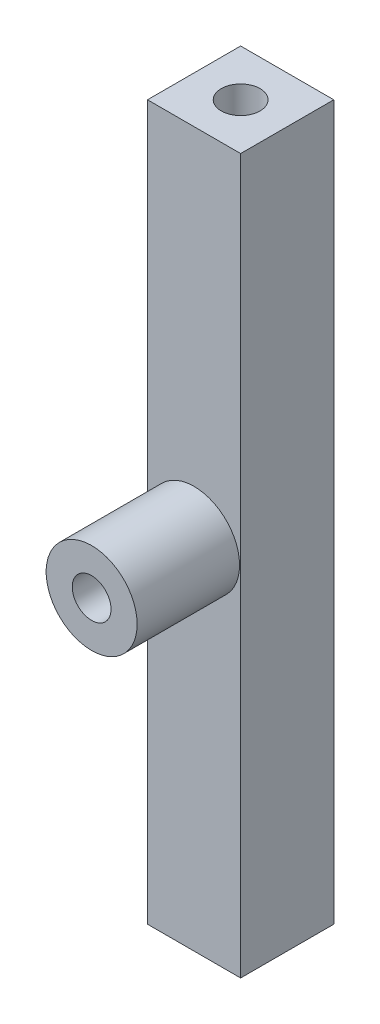
ISO-10303-21;
HEADER;
FILE_DESCRIPTION(('STEP AP214'),'2;1');
FILE_NAME('part.step','',(''),(''),'','','');
FILE_SCHEMA(('AUTOMOTIVE_DESIGN { 1 0 10303 214 1 1 1 1 }'));
ENDSEC;
DATA;
#1=APPLICATION_CONTEXT('core data for automotive mechanical design processes');
#2=APPLICATION_PROTOCOL_DEFINITION('international standard','automotive_design',2000,#1);
#3=PRODUCT_CONTEXT('',#1,'mechanical');
#4=PRODUCT('Part','Part','',(#3));
#5=PRODUCT_RELATED_PRODUCT_CATEGORY('part','',(#4));
#6=PRODUCT_DEFINITION_FORMATION('','',#4);
#7=PRODUCT_DEFINITION_CONTEXT('part definition',#1,'design');
#8=PRODUCT_DEFINITION('design','',#6,#7);
#9=PRODUCT_DEFINITION_SHAPE('','',#8);
#10=(LENGTH_UNIT() NAMED_UNIT(*) SI_UNIT(.MILLI.,.METRE.));
#11=(NAMED_UNIT(*) PLANE_ANGLE_UNIT() SI_UNIT($,.RADIAN.));
#12=(NAMED_UNIT(*) SI_UNIT($,.STERADIAN.) SOLID_ANGLE_UNIT());
#13=UNCERTAINTY_MEASURE_WITH_UNIT(LENGTH_MEASURE(1.E-05),#10,'distance_accuracy_value','');
#14=(GEOMETRIC_REPRESENTATION_CONTEXT(3) GLOBAL_UNCERTAINTY_ASSIGNED_CONTEXT((#13)) GLOBAL_UNIT_ASSIGNED_CONTEXT((#10,
#11,#12)) REPRESENTATION_CONTEXT('',''));
#15=CARTESIAN_POINT('',(0.,0.,0.));
#16=DIRECTION('',(0.,0.,1.));
#17=DIRECTION('',(1.,0.,0.));
#18=AXIS2_PLACEMENT_3D('',#15,#16,#17);
#19=CARTESIAN_POINT('',(3.,23.,6.));
#20=DIRECTION('',(-1.,0.,0.));
#21=DIRECTION('',(0.,-1.,0.));
#22=AXIS2_PLACEMENT_3D('',#19,#20,#21);
#23=PLANE('',#22);
#24=DIRECTION('',(0.,1.,0.));
#25=VECTOR('',#24,1.);
#26=CARTESIAN_POINT('',(3.,23.,0.));
#27=LINE('',#26,#25);
#28=CARTESIAN_POINT('',(3.,-23.,0.));
#29=VERTEX_POINT('',#28);
#30=CARTESIAN_POINT('',(3.,23.,0.));
#31=VERTEX_POINT('',#30);
#32=EDGE_CURVE('E98',#29,#31,#27,.T.);
#33=ORIENTED_EDGE('',*,*,#32,.T.);
#34=DIRECTION('',(0.,0.,-1.));
#35=VECTOR('',#34,1.);
#36=CARTESIAN_POINT('',(3.,23.,6.));
#37=LINE('',#36,#35);
#38=CARTESIAN_POINT('',(3.,23.,6.));
#39=VERTEX_POINT('',#38);
#40=EDGE_CURVE('E11',#39,#31,#37,.T.);
#41=ORIENTED_EDGE('',*,*,#40,.F.);
#42=DIRECTION('',(0.,1.,0.));
#43=VECTOR('',#42,1.);
#44=CARTESIAN_POINT('',(3.,23.,6.));
#45=LINE('',#44,#43);
#46=CARTESIAN_POINT('',(3.,-23.,6.));
#47=VERTEX_POINT('',#46);
#48=EDGE_CURVE('E86',#47,#39,#45,.T.);
#49=ORIENTED_EDGE('',*,*,#48,.F.);
#50=DIRECTION('',(0.,0.,-1.));
#51=VECTOR('',#50,1.);
#52=CARTESIAN_POINT('',(3.,-23.,6.));
#53=LINE('',#52,#51);
#54=EDGE_CURVE('E94',#47,#29,#53,.T.);
#55=ORIENTED_EDGE('',*,*,#54,.T.);
#56=EDGE_LOOP('',(#33,#41,#49,#55));
#57=FACE_BOUND('',#56,.T.);
#58=ADVANCED_FACE('F35',(#57),#23,.F.);
#59=CARTESIAN_POINT('',(-3.,23.,6.));
#60=DIRECTION('',(0.,-1.,0.));
#61=DIRECTION('',(0.,0.,-1.));
#62=AXIS2_PLACEMENT_3D('',#59,#60,#61);
#63=PLANE('',#62);
#64=CARTESIAN_POINT('',(0.,23.,3.));
#65=DIRECTION('',(0.,1.,0.));
#66=DIRECTION('',(0.,0.,1.));
#67=AXIS2_PLACEMENT_3D('',#64,#65,#66);
#68=CIRCLE('',#67,1.25);
#69=CARTESIAN_POINT('',(0.,23.,4.25));
#70=VERTEX_POINT('',#69);
#71=EDGE_CURVE('E112',#70,#70,#68,.T.);
#72=ORIENTED_EDGE('',*,*,#71,.F.);
#73=EDGE_LOOP('',(#72));
#74=FACE_BOUND('',#73,.T.);
#75=DIRECTION('',(-1.,0.,0.));
#76=VECTOR('',#75,1.);
#77=CARTESIAN_POINT('',(-3.,23.,0.));
#78=LINE('',#77,#76);
#79=CARTESIAN_POINT('',(-3.,23.,0.));
#80=VERTEX_POINT('',#79);
#81=EDGE_CURVE('E90',#31,#80,#78,.T.);
#82=ORIENTED_EDGE('',*,*,#81,.T.);
#83=DIRECTION('',(0.,0.,-1.));
#84=VECTOR('',#83,1.);
#85=CARTESIAN_POINT('',(-3.,23.,6.));
#86=LINE('',#85,#84);
#87=CARTESIAN_POINT('',(-3.,23.,6.));
#88=VERTEX_POINT('',#87);
#89=EDGE_CURVE('E43',#88,#80,#86,.T.);
#90=ORIENTED_EDGE('',*,*,#89,.F.);
#91=DIRECTION('',(-1.,0.,0.));
#92=VECTOR('',#91,1.);
#93=CARTESIAN_POINT('',(-3.,23.,6.));
#94=LINE('',#93,#92);
#95=EDGE_CURVE('E81',#39,#88,#94,.T.);
#96=ORIENTED_EDGE('',*,*,#95,.F.);
#97=ORIENTED_EDGE('',*,*,#40,.T.);
#98=EDGE_LOOP('',(#82,#90,#96,#97));
#99=FACE_BOUND('',#98,.T.);
#100=ADVANCED_FACE('F89',(#74,#99),#63,.F.);
#101=CARTESIAN_POINT('',(-3.,23.,6.));
#102=DIRECTION('',(1.,0.,0.));
#103=DIRECTION('',(0.,1.,0.));
#104=AXIS2_PLACEMENT_3D('',#101,#102,#103);
#105=PLANE('',#104);
#106=DIRECTION('',(0.,-1.,0.));
#107=VECTOR('',#106,1.);
#108=CARTESIAN_POINT('',(-3.,23.,0.));
#109=LINE('',#108,#107);
#110=CARTESIAN_POINT('',(-3.,-23.,0.));
#111=VERTEX_POINT('',#110);
#112=EDGE_CURVE('E68',#80,#111,#109,.T.);
#113=ORIENTED_EDGE('',*,*,#112,.T.);
#114=DIRECTION('',(0.,0.,-1.));
#115=VECTOR('',#114,1.);
#116=CARTESIAN_POINT('',(-3.,-23.,6.));
#117=LINE('',#116,#115);
#118=CARTESIAN_POINT('',(-3.,-23.,6.));
#119=VERTEX_POINT('',#118);
#120=EDGE_CURVE('E91',#119,#111,#117,.T.);
#121=ORIENTED_EDGE('',*,*,#120,.F.);
#122=DIRECTION('',(0.,-1.,0.));
#123=VECTOR('',#122,1.);
#124=CARTESIAN_POINT('',(-3.,23.,6.));
#125=LINE('',#124,#123);
#126=EDGE_CURVE('E84',#88,#119,#125,.T.);
#127=ORIENTED_EDGE('',*,*,#126,.F.);
#128=ORIENTED_EDGE('',*,*,#89,.T.);
#129=EDGE_LOOP('',(#113,#121,#127,#128));
#130=FACE_BOUND('',#129,.T.);
#131=ADVANCED_FACE('F92',(#130),#105,.F.);
#132=CARTESIAN_POINT('',(-3.,-23.,6.));
#133=DIRECTION('',(0.,1.,0.));
#134=DIRECTION('',(0.,0.,1.));
#135=AXIS2_PLACEMENT_3D('',#132,#133,#134);
#136=PLANE('',#135);
#137=CARTESIAN_POINT('',(0.,-23.,3.));
#138=DIRECTION('',(0.,-1.,0.));
#139=DIRECTION('',(0.,0.,-1.));
#140=AXIS2_PLACEMENT_3D('',#137,#138,#139);
#141=CIRCLE('',#140,1.25);
#142=CARTESIAN_POINT('',(0.,-23.,1.75));
#143=VERTEX_POINT('',#142);
#144=EDGE_CURVE('E118',#143,#143,#141,.T.);
#145=ORIENTED_EDGE('',*,*,#144,.F.);
#146=EDGE_LOOP('',(#145));
#147=FACE_BOUND('',#146,.T.);
#148=DIRECTION('',(1.,0.,0.));
#149=VECTOR('',#148,1.);
#150=CARTESIAN_POINT('',(-3.,-23.,0.));
#151=LINE('',#150,#149);
#152=EDGE_CURVE('E74',#111,#29,#151,.T.);
#153=ORIENTED_EDGE('',*,*,#152,.T.);
#154=ORIENTED_EDGE('',*,*,#54,.F.);
#155=DIRECTION('',(1.,0.,0.));
#156=VECTOR('',#155,1.);
#157=CARTESIAN_POINT('',(-3.,-23.,6.));
#158=LINE('',#157,#156);
#159=EDGE_CURVE('E51',#119,#47,#158,.T.);
#160=ORIENTED_EDGE('',*,*,#159,.F.);
#161=ORIENTED_EDGE('',*,*,#120,.T.);
#162=EDGE_LOOP('',(#153,#154,#160,#161));
#163=FACE_BOUND('',#162,.T.);
#164=ADVANCED_FACE('F106',(#147,#163),#136,.F.);
#165=CARTESIAN_POINT('',(0.,0.,6.));
#166=DIRECTION('',(0.,0.,1.));
#167=DIRECTION('',(1.,0.,0.));
#168=AXIS2_PLACEMENT_3D('',#165,#166,#167);
#169=PLANE('',#168);
#170=CARTESIAN_POINT('',(0.,0.,6.));
#171=DIRECTION('',(0.,0.,1.));
#172=DIRECTION('',(1.,0.,0.));
#173=AXIS2_PLACEMENT_3D('',#170,#171,#172);
#174=CIRCLE('',#173,2.93);
#175=CARTESIAN_POINT('',(2.93,0.,6.));
#176=VERTEX_POINT('',#175);
#177=EDGE_CURVE('E124',#176,#176,#174,.T.);
#178=ORIENTED_EDGE('',*,*,#177,.F.);
#179=EDGE_LOOP('',(#178));
#180=FACE_BOUND('',#179,.T.);
#181=ORIENTED_EDGE('',*,*,#48,.T.);
#182=ORIENTED_EDGE('',*,*,#95,.T.);
#183=ORIENTED_EDGE('',*,*,#126,.T.);
#184=ORIENTED_EDGE('',*,*,#159,.T.);
#185=EDGE_LOOP('',(#181,#182,#183,#184));
#186=FACE_BOUND('',#185,.T.);
#187=ADVANCED_FACE('F82',(#180,#186),#169,.T.);
#188=CARTESIAN_POINT('',(0.,0.,0.));
#189=DIRECTION('',(0.,0.,1.));
#190=DIRECTION('',(1.,0.,0.));
#191=AXIS2_PLACEMENT_3D('',#188,#189,#190);
#192=PLANE('',#191);
#193=ORIENTED_EDGE('',*,*,#32,.F.);
#194=ORIENTED_EDGE('',*,*,#152,.F.);
#195=ORIENTED_EDGE('',*,*,#112,.F.);
#196=ORIENTED_EDGE('',*,*,#81,.F.);
#197=EDGE_LOOP('',(#193,#194,#195,#196));
#198=FACE_BOUND('',#197,.T.);
#199=ADVANCED_FACE('F109',(#198),#192,.F.);
#200=CARTESIAN_POINT('',(0.,13.,3.));
#201=DIRECTION('',(0.,1.,0.));
#202=DIRECTION('',(0.,0.,1.));
#203=AXIS2_PLACEMENT_3D('',#200,#201,#202);
#204=CYLINDRICAL_SURFACE('',#203,1.25);
#205=CARTESIAN_POINT('',(0.,13.,3.));
#206=DIRECTION('',(0.,1.,0.));
#207=DIRECTION('',(0.,0.,1.));
#208=AXIS2_PLACEMENT_3D('',#205,#206,#207);
#209=CIRCLE('',#208,1.25);
#210=CARTESIAN_POINT('',(0.,13.,4.25));
#211=VERTEX_POINT('',#210);
#212=EDGE_CURVE('E101',#211,#211,#209,.T.);
#213=ORIENTED_EDGE('',*,*,#212,.F.);
#214=EDGE_LOOP('',(#213));
#215=FACE_BOUND('',#214,.T.);
#216=ORIENTED_EDGE('',*,*,#71,.T.);
#217=EDGE_LOOP('',(#216));
#218=FACE_BOUND('',#217,.T.);
#219=ADVANCED_FACE('F163',(#215,#218),#204,.F.);
#220=CARTESIAN_POINT('',(0.,13.,3.));
#221=DIRECTION('',(0.,1.,0.));
#222=DIRECTION('',(0.,0.,1.));
#223=AXIS2_PLACEMENT_3D('',#220,#221,#222);
#224=PLANE('',#223);
#225=ORIENTED_EDGE('',*,*,#212,.T.);
#226=EDGE_LOOP('',(#225));
#227=FACE_BOUND('',#226,.T.);
#228=ADVANCED_FACE('F180',(#227),#224,.T.);
#229=CARTESIAN_POINT('',(0.,-13.,3.));
#230=DIRECTION('',(0.,-1.,0.));
#231=DIRECTION('',(0.,0.,-1.));
#232=AXIS2_PLACEMENT_3D('',#229,#230,#231);
#233=CYLINDRICAL_SURFACE('',#232,1.25);
#234=CARTESIAN_POINT('',(0.,-13.,3.));
#235=DIRECTION('',(0.,-1.,0.));
#236=DIRECTION('',(0.,0.,-1.));
#237=AXIS2_PLACEMENT_3D('',#234,#235,#236);
#238=CIRCLE('',#237,1.25);
#239=CARTESIAN_POINT('',(0.,-13.,1.75));
#240=VERTEX_POINT('',#239);
#241=EDGE_CURVE('E115',#240,#240,#238,.T.);
#242=ORIENTED_EDGE('',*,*,#241,.F.);
#243=EDGE_LOOP('',(#242));
#244=FACE_BOUND('',#243,.T.);
#245=ORIENTED_EDGE('',*,*,#144,.T.);
#246=EDGE_LOOP('',(#245));
#247=FACE_BOUND('',#246,.T.);
#248=ADVANCED_FACE('F185',(#244,#247),#233,.F.);
#249=CARTESIAN_POINT('',(0.,-13.,3.));
#250=DIRECTION('',(0.,-1.,0.));
#251=DIRECTION('',(0.,0.,-1.));
#252=AXIS2_PLACEMENT_3D('',#249,#250,#251);
#253=PLANE('',#252);
#254=ORIENTED_EDGE('',*,*,#241,.T.);
#255=EDGE_LOOP('',(#254));
#256=FACE_BOUND('',#255,.T.);
#257=ADVANCED_FACE('F153',(#256),#253,.T.);
#258=CARTESIAN_POINT('',(0.,0.,12.6));
#259=DIRECTION('',(0.,0.,-1.));
#260=DIRECTION('',(-1.,0.,0.));
#261=AXIS2_PLACEMENT_3D('',#258,#259,#260);
#262=CYLINDRICAL_SURFACE('',#261,2.93);
#263=CARTESIAN_POINT('',(0.,0.,12.6));
#264=DIRECTION('',(0.,0.,1.));
#265=DIRECTION('',(1.,0.,0.));
#266=AXIS2_PLACEMENT_3D('',#263,#264,#265);
#267=CIRCLE('',#266,2.93);
#268=CARTESIAN_POINT('',(2.93,0.,12.6));
#269=VERTEX_POINT('',#268);
#270=EDGE_CURVE('E121',#269,#269,#267,.T.);
#271=ORIENTED_EDGE('',*,*,#270,.F.);
#272=EDGE_LOOP('',(#271));
#273=FACE_BOUND('',#272,.T.);
#274=ORIENTED_EDGE('',*,*,#177,.T.);
#275=EDGE_LOOP('',(#274));
#276=FACE_BOUND('',#275,.T.);
#277=ADVANCED_FACE('F147',(#273,#276),#262,.T.);
#278=CARTESIAN_POINT('',(0.,0.,12.6));
#279=DIRECTION('',(0.,0.,1.));
#280=DIRECTION('',(1.,0.,0.));
#281=AXIS2_PLACEMENT_3D('',#278,#279,#280);
#282=PLANE('',#281);
#283=CARTESIAN_POINT('',(0.,0.,12.6));
#284=DIRECTION('',(0.,0.,1.));
#285=DIRECTION('',(1.,0.,0.));
#286=AXIS2_PLACEMENT_3D('',#283,#284,#285);
#287=CIRCLE('',#286,1.25);
#288=CARTESIAN_POINT('',(1.25,0.,12.6));
#289=VERTEX_POINT('',#288);
#290=EDGE_CURVE('E130',#289,#289,#287,.T.);
#291=ORIENTED_EDGE('',*,*,#290,.F.);
#292=EDGE_LOOP('',(#291));
#293=FACE_BOUND('',#292,.T.);
#294=ORIENTED_EDGE('',*,*,#270,.T.);
#295=EDGE_LOOP('',(#294));
#296=FACE_BOUND('',#295,.T.);
#297=ADVANCED_FACE('F141',(#293,#296),#282,.T.);
#298=CARTESIAN_POINT('',(0.,0.,5.6));
#299=DIRECTION('',(0.,0.,1.));
#300=DIRECTION('',(1.,0.,0.));
#301=AXIS2_PLACEMENT_3D('',#298,#299,#300);
#302=CYLINDRICAL_SURFACE('',#301,1.25);
#303=CARTESIAN_POINT('',(0.,0.,5.6));
#304=DIRECTION('',(0.,0.,1.));
#305=DIRECTION('',(1.,0.,0.));
#306=AXIS2_PLACEMENT_3D('',#303,#304,#305);
#307=CIRCLE('',#306,1.25);
#308=CARTESIAN_POINT('',(1.25,0.,5.6));
#309=VERTEX_POINT('',#308);
#310=EDGE_CURVE('E127',#309,#309,#307,.T.);
#311=ORIENTED_EDGE('',*,*,#310,.F.);
#312=EDGE_LOOP('',(#311));
#313=FACE_BOUND('',#312,.T.);
#314=ORIENTED_EDGE('',*,*,#290,.T.);
#315=EDGE_LOOP('',(#314));
#316=FACE_BOUND('',#315,.T.);
#317=ADVANCED_FACE('F138',(#313,#316),#302,.F.);
#318=CARTESIAN_POINT('',(0.,0.,5.6));
#319=DIRECTION('',(0.,0.,1.));
#320=DIRECTION('',(1.,0.,0.));
#321=AXIS2_PLACEMENT_3D('',#318,#319,#320);
#322=PLANE('',#321);
#323=ORIENTED_EDGE('',*,*,#310,.T.);
#324=EDGE_LOOP('',(#323));
#325=FACE_BOUND('',#324,.T.);
#326=ADVANCED_FACE('F136',(#325),#322,.T.);
#327=CLOSED_SHELL('',(#58,#100,#131,#164,#187,#199,#219,#228,#248,#257,#277,#297,#317,#326));
#328=MANIFOLD_SOLID_BREP('B2',#327);
#329=ADVANCED_BREP_SHAPE_REPRESENTATION('',(#18,#328),#14);
#330=SHAPE_DEFINITION_REPRESENTATION(#9,#329);
ENDSEC;
END-ISO-10303-21;
